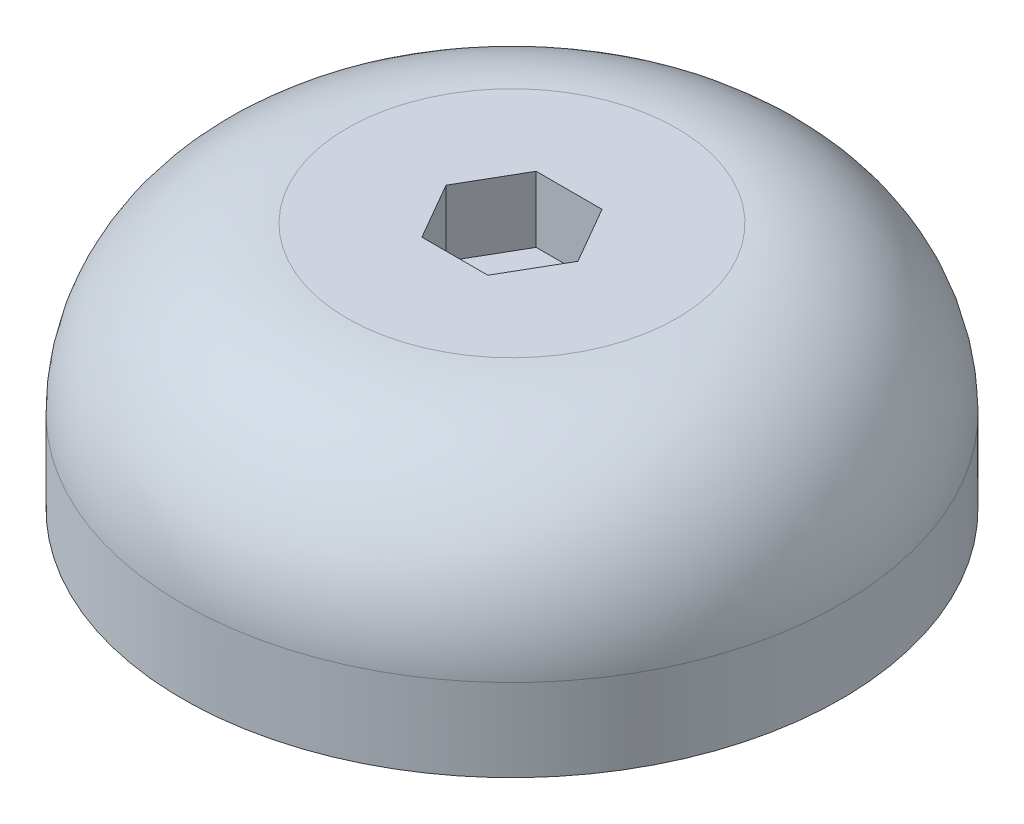
ISO-10303-21;
HEADER;
FILE_DESCRIPTION(('STEP AP214'),'2;1');
FILE_NAME('part.step','',(''),(''),'','','');
FILE_SCHEMA(('AUTOMOTIVE_DESIGN { 1 0 10303 214 1 1 1 1 }'));
ENDSEC;
DATA;
#1=APPLICATION_CONTEXT('core data for automotive mechanical design processes');
#2=APPLICATION_PROTOCOL_DEFINITION('international standard','automotive_design',2000,#1);
#3=PRODUCT_CONTEXT('',#1,'mechanical');
#4=PRODUCT('Part','Part','',(#3));
#5=PRODUCT_RELATED_PRODUCT_CATEGORY('part','',(#4));
#6=PRODUCT_DEFINITION_FORMATION('','',#4);
#7=PRODUCT_DEFINITION_CONTEXT('part definition',#1,'design');
#8=PRODUCT_DEFINITION('design','',#6,#7);
#9=PRODUCT_DEFINITION_SHAPE('','',#8);
#10=(LENGTH_UNIT() NAMED_UNIT(*) SI_UNIT(.MILLI.,.METRE.));
#11=(NAMED_UNIT(*) PLANE_ANGLE_UNIT() SI_UNIT($,.RADIAN.));
#12=(NAMED_UNIT(*) SI_UNIT($,.STERADIAN.) SOLID_ANGLE_UNIT());
#13=UNCERTAINTY_MEASURE_WITH_UNIT(LENGTH_MEASURE(1.E-05),#10,'distance_accuracy_value','');
#14=(GEOMETRIC_REPRESENTATION_CONTEXT(3) GLOBAL_UNCERTAINTY_ASSIGNED_CONTEXT((#13)) GLOBAL_UNIT_ASSIGNED_CONTEXT((#10,
#11,#12)) REPRESENTATION_CONTEXT('',''));
#15=CARTESIAN_POINT('',(0.,0.,0.));
#16=DIRECTION('',(0.,0.,1.));
#17=DIRECTION('',(1.,0.,0.));
#18=AXIS2_PLACEMENT_3D('',#15,#16,#17);
#19=CARTESIAN_POINT('',(0.,3.,0.));
#20=DIRECTION('',(0.,-1.,0.));
#21=DIRECTION('',(0.,0.,-1.));
#22=AXIS2_PLACEMENT_3D('',#19,#20,#21);
#23=CYLINDRICAL_SURFACE('',#22,2.);
#24=CARTESIAN_POINT('',(0.,0.,0.));
#25=DIRECTION('',(0.,1.,0.));
#26=DIRECTION('',(0.,0.,1.));
#27=AXIS2_PLACEMENT_3D('',#24,#25,#26);
#28=CIRCLE('',#27,2.);
#29=CARTESIAN_POINT('',(0.,0.,2.));
#30=VERTEX_POINT('',#29);
#31=EDGE_CURVE('E192',#30,#30,#28,.T.);
#32=ORIENTED_EDGE('',*,*,#31,.F.);
#33=EDGE_LOOP('',(#32));
#34=FACE_BOUND('',#33,.T.);
#35=CARTESIAN_POINT('',(0.,7.,0.));
#36=DIRECTION('',(0.,1.,0.));
#37=DIRECTION('',(0.,0.,1.));
#38=AXIS2_PLACEMENT_3D('',#35,#36,#37);
#39=CIRCLE('',#38,2.);
#40=CARTESIAN_POINT('',(0.,7.,2.));
#41=VERTEX_POINT('',#40);
#42=EDGE_CURVE('E157',#41,#41,#39,.T.);
#43=ORIENTED_EDGE('',*,*,#42,.T.);
#44=EDGE_LOOP('',(#43));
#45=FACE_BOUND('',#44,.T.);
#46=ADVANCED_FACE('F33',(#34,#45),#23,.F.);
#47=CARTESIAN_POINT('',(0.,0.,0.));
#48=DIRECTION('',(0.,1.,0.));
#49=DIRECTION('',(0.,0.,1.));
#50=AXIS2_PLACEMENT_3D('',#47,#48,#49);
#51=PLANE('',#50);
#52=DIRECTION('',(1.,0.,0.));
#53=VECTOR('',#52,1.);
#54=CARTESIAN_POINT('',(-1.6303294476589,0.,-7.61644171442611));
#55=LINE('',#54,#53);
#56=CARTESIAN_POINT('',(-1.6303294476589,0.,-7.61644171442611));
#57=VERTEX_POINT('',#56);
#58=CARTESIAN_POINT('',(1.5696705523411,0.,-7.61644171442611));
#59=VERTEX_POINT('',#58);
#60=EDGE_CURVE('E182',#57,#59,#55,.T.);
#61=ORIENTED_EDGE('',*,*,#60,.F.);
#62=DIRECTION('',(0.,0.,-1.));
#63=VECTOR('',#62,1.);
#64=CARTESIAN_POINT('',(-1.6303294476589,0.,-4.41644171442611));
#65=LINE('',#64,#63);
#66=CARTESIAN_POINT('',(-1.6303294476589,0.,-4.41644171442611));
#67=VERTEX_POINT('',#66);
#68=EDGE_CURVE('E168',#67,#57,#65,.T.);
#69=ORIENTED_EDGE('',*,*,#68,.F.);
#70=DIRECTION('',(-1.,0.,0.));
#71=VECTOR('',#70,1.);
#72=CARTESIAN_POINT('',(-1.6303294476589,0.,-4.41644171442611));
#73=LINE('',#72,#71);
#74=CARTESIAN_POINT('',(1.5696705523411,0.,-4.41644171442611));
#75=VERTEX_POINT('',#74);
#76=EDGE_CURVE('E173',#75,#67,#73,.T.);
#77=ORIENTED_EDGE('',*,*,#76,.F.);
#78=DIRECTION('',(0.,0.,1.));
#79=VECTOR('',#78,1.);
#80=CARTESIAN_POINT('',(1.5696705523411,0.,-4.41644171442611));
#81=LINE('',#80,#79);
#82=EDGE_CURVE('E185',#59,#75,#81,.T.);
#83=ORIENTED_EDGE('',*,*,#82,.F.);
#84=EDGE_LOOP('',(#61,#69,#77,#83));
#85=FACE_BOUND('',#84,.T.);
#86=CARTESIAN_POINT('',(0.,0.,0.));
#87=DIRECTION('',(0.,1.,0.));
#88=DIRECTION('',(0.,0.,1.));
#89=AXIS2_PLACEMENT_3D('',#86,#87,#88);
#90=CIRCLE('',#89,9.75);
#91=CARTESIAN_POINT('',(0.,0.,9.75));
#92=VERTEX_POINT('',#91);
#93=EDGE_CURVE('E201',#92,#92,#90,.T.);
#94=ORIENTED_EDGE('',*,*,#93,.F.);
#95=EDGE_LOOP('',(#94));
#96=FACE_BOUND('',#95,.T.);
#97=ORIENTED_EDGE('',*,*,#31,.T.);
#98=EDGE_LOOP('',(#97));
#99=FACE_BOUND('',#98,.T.);
#100=ADVANCED_FACE('F226',(#85,#96,#99),#51,.F.);
#101=CARTESIAN_POINT('',(-1.6303294476589,3.,-4.41644171442611));
#102=DIRECTION('',(-1.,0.,0.));
#103=DIRECTION('',(0.,0.,1.));
#104=AXIS2_PLACEMENT_3D('',#101,#102,#103);
#105=PLANE('',#104);
#106=ORIENTED_EDGE('',*,*,#68,.T.);
#107=DIRECTION('',(0.,-1.,0.));
#108=VECTOR('',#107,1.);
#109=CARTESIAN_POINT('',(-1.6303294476589,3.,-7.61644171442611));
#110=LINE('',#109,#108);
#111=CARTESIAN_POINT('',(-1.6303294476589,3.,-7.61644171442611));
#112=VERTEX_POINT('',#111);
#113=EDGE_CURVE('E180',#112,#57,#110,.T.);
#114=ORIENTED_EDGE('',*,*,#113,.F.);
#115=DIRECTION('',(0.,0.,-1.));
#116=VECTOR('',#115,1.);
#117=CARTESIAN_POINT('',(-1.6303294476589,3.,-4.41644171442611));
#118=LINE('',#117,#116);
#119=CARTESIAN_POINT('',(-1.6303294476589,3.,-4.41644171442611));
#120=VERTEX_POINT('',#119);
#121=EDGE_CURVE('E169',#120,#112,#118,.T.);
#122=ORIENTED_EDGE('',*,*,#121,.F.);
#123=DIRECTION('',(0.,-1.,0.));
#124=VECTOR('',#123,1.);
#125=CARTESIAN_POINT('',(-1.6303294476589,3.,-4.41644171442611));
#126=LINE('',#125,#124);
#127=EDGE_CURVE('E190',#120,#67,#126,.T.);
#128=ORIENTED_EDGE('',*,*,#127,.T.);
#129=EDGE_LOOP('',(#106,#114,#122,#128));
#130=FACE_BOUND('',#129,.T.);
#131=ADVANCED_FACE('F232',(#130),#105,.F.);
#132=CARTESIAN_POINT('',(-1.6303294476589,3.,-4.41644171442611));
#133=DIRECTION('',(0.,0.,1.));
#134=DIRECTION('',(1.,0.,0.));
#135=AXIS2_PLACEMENT_3D('',#132,#133,#134);
#136=PLANE('',#135);
#137=ORIENTED_EDGE('',*,*,#76,.T.);
#138=ORIENTED_EDGE('',*,*,#127,.F.);
#139=DIRECTION('',(-1.,0.,0.));
#140=VECTOR('',#139,1.);
#141=CARTESIAN_POINT('',(-1.6303294476589,3.,-4.41644171442611));
#142=LINE('',#141,#140);
#143=CARTESIAN_POINT('',(1.5696705523411,3.,-4.41644171442611));
#144=VERTEX_POINT('',#143);
#145=EDGE_CURVE('E177',#144,#120,#142,.T.);
#146=ORIENTED_EDGE('',*,*,#145,.F.);
#147=DIRECTION('',(0.,-1.,0.));
#148=VECTOR('',#147,1.);
#149=CARTESIAN_POINT('',(1.5696705523411,3.,-4.41644171442611));
#150=LINE('',#149,#148);
#151=EDGE_CURVE('E193',#144,#75,#150,.T.);
#152=ORIENTED_EDGE('',*,*,#151,.T.);
#153=EDGE_LOOP('',(#137,#138,#146,#152));
#154=FACE_BOUND('',#153,.T.);
#155=ADVANCED_FACE('F273',(#154),#136,.F.);
#156=CARTESIAN_POINT('',(1.5696705523411,3.,-4.41644171442611));
#157=DIRECTION('',(1.,0.,0.));
#158=DIRECTION('',(0.,0.,-1.));
#159=AXIS2_PLACEMENT_3D('',#156,#157,#158);
#160=PLANE('',#159);
#161=ORIENTED_EDGE('',*,*,#82,.T.);
#162=ORIENTED_EDGE('',*,*,#151,.F.);
#163=DIRECTION('',(0.,0.,1.));
#164=VECTOR('',#163,1.);
#165=CARTESIAN_POINT('',(1.5696705523411,3.,-4.41644171442611));
#166=LINE('',#165,#164);
#167=CARTESIAN_POINT('',(1.5696705523411,3.,-7.61644171442611));
#168=VERTEX_POINT('',#167);
#169=EDGE_CURVE('E56',#168,#144,#166,.T.);
#170=ORIENTED_EDGE('',*,*,#169,.F.);
#171=DIRECTION('',(0.,-1.,0.));
#172=VECTOR('',#171,1.);
#173=CARTESIAN_POINT('',(1.5696705523411,3.,-7.61644171442611));
#174=LINE('',#173,#172);
#175=EDGE_CURVE('E195',#168,#59,#174,.T.);
#176=ORIENTED_EDGE('',*,*,#175,.T.);
#177=EDGE_LOOP('',(#161,#162,#170,#176));
#178=FACE_BOUND('',#177,.T.);
#179=ADVANCED_FACE('F276',(#178),#160,.F.);
#180=CARTESIAN_POINT('',(-1.6303294476589,3.,-7.61644171442611));
#181=DIRECTION('',(0.,0.,-1.));
#182=DIRECTION('',(-1.,0.,0.));
#183=AXIS2_PLACEMENT_3D('',#180,#181,#182);
#184=PLANE('',#183);
#185=ORIENTED_EDGE('',*,*,#60,.T.);
#186=ORIENTED_EDGE('',*,*,#175,.F.);
#187=DIRECTION('',(1.,0.,0.));
#188=VECTOR('',#187,1.);
#189=CARTESIAN_POINT('',(-1.6303294476589,3.,-7.61644171442611));
#190=LINE('',#189,#188);
#191=EDGE_CURVE('E172',#112,#168,#190,.T.);
#192=ORIENTED_EDGE('',*,*,#191,.F.);
#193=ORIENTED_EDGE('',*,*,#113,.T.);
#194=EDGE_LOOP('',(#185,#186,#192,#193));
#195=FACE_BOUND('',#194,.T.);
#196=ADVANCED_FACE('F270',(#195),#184,.F.);
#197=CARTESIAN_POINT('',(0.,3.,0.));
#198=DIRECTION('',(0.,1.,0.));
#199=DIRECTION('',(0.,0.,1.));
#200=AXIS2_PLACEMENT_3D('',#197,#198,#199);
#201=PLANE('',#200);
#202=ORIENTED_EDGE('',*,*,#145,.T.);
#203=ORIENTED_EDGE('',*,*,#121,.T.);
#204=ORIENTED_EDGE('',*,*,#191,.T.);
#205=ORIENTED_EDGE('',*,*,#169,.T.);
#206=EDGE_LOOP('',(#202,#203,#204,#205));
#207=FACE_BOUND('',#206,.T.);
#208=ADVANCED_FACE('F268',(#207),#201,.F.);
#209=CARTESIAN_POINT('',(0.,-4.,0.));
#210=DIRECTION('',(0.,1.,0.));
#211=DIRECTION('',(0.,0.,1.));
#212=AXIS2_PLACEMENT_3D('',#209,#210,#211);
#213=CYLINDRICAL_SURFACE('',#212,9.75);
#214=CARTESIAN_POINT('',(0.,-3.5,0.));
#215=DIRECTION('',(0.,-1.,0.));
#216=DIRECTION('',(0.,0.,-1.));
#217=AXIS2_PLACEMENT_3D('',#214,#215,#216);
#218=CIRCLE('',#217,9.75);
#219=CARTESIAN_POINT('',(0.,-3.5,-9.75));
#220=VERTEX_POINT('',#219);
#221=EDGE_CURVE('E41',#220,#220,#218,.T.);
#222=ORIENTED_EDGE('',*,*,#221,.T.);
#223=EDGE_LOOP('',(#222));
#224=FACE_BOUND('',#223,.T.);
#225=ORIENTED_EDGE('',*,*,#93,.T.);
#226=EDGE_LOOP('',(#225));
#227=FACE_BOUND('',#226,.T.);
#228=ADVANCED_FACE('F214',(#224,#227),#213,.F.);
#229=CARTESIAN_POINT('',(0.,-4.,0.));
#230=DIRECTION('',(0.,-1.,0.));
#231=DIRECTION('',(0.,0.,-1.));
#232=AXIS2_PLACEMENT_3D('',#229,#230,#231);
#233=PLANE('',#232);
#234=CARTESIAN_POINT('',(0.,-4.,0.));
#235=DIRECTION('',(0.,-1.,0.));
#236=DIRECTION('',(0.,0.,-1.));
#237=AXIS2_PLACEMENT_3D('',#234,#235,#236);
#238=CIRCLE('',#237,10.25);
#239=CARTESIAN_POINT('',(0.,-4.,-10.25));
#240=VERTEX_POINT('',#239);
#241=EDGE_CURVE('E11',#240,#240,#238,.F.);
#242=ORIENTED_EDGE('',*,*,#241,.T.);
#243=EDGE_LOOP('',(#242));
#244=FACE_BOUND('',#243,.T.);
#245=CARTESIAN_POINT('',(0.,-4.,0.));
#246=DIRECTION('',(0.,-1.,0.));
#247=DIRECTION('',(0.,0.,-1.));
#248=AXIS2_PLACEMENT_3D('',#245,#246,#247);
#249=CIRCLE('',#248,20.);
#250=CARTESIAN_POINT('',(0.,-4.,-20.));
#251=VERTEX_POINT('',#250);
#252=EDGE_CURVE('E165',#251,#251,#249,.T.);
#253=ORIENTED_EDGE('',*,*,#252,.T.);
#254=EDGE_LOOP('',(#253));
#255=FACE_BOUND('',#254,.T.);
#256=ADVANCED_FACE('F257',(#244,#255),#233,.T.);
#257=CARTESIAN_POINT('',(0.,11.,0.));
#258=DIRECTION('',(0.,1.,0.));
#259=DIRECTION('',(0.,0.,1.));
#260=AXIS2_PLACEMENT_3D('',#257,#258,#259);
#261=PLANE('',#260);
#262=DIRECTION('',(0.5,0.,-0.866025403784439));
#263=VECTOR('',#262,1.);
#264=CARTESIAN_POINT('',(2.00051868274205,11.,3.465));
#265=LINE('',#264,#263);
#266=CARTESIAN_POINT('',(2.00051868274205,11.,3.465));
#267=VERTEX_POINT('',#266);
#268=CARTESIAN_POINT('',(4.00103736548411,11.,0.));
#269=VERTEX_POINT('',#268);
#270=EDGE_CURVE('E48',#267,#269,#265,.T.);
#271=ORIENTED_EDGE('',*,*,#270,.F.);
#272=DIRECTION('',(1.,0.,0.));
#273=VECTOR('',#272,1.);
#274=CARTESIAN_POINT('',(-2.00051868274205,11.,3.465));
#275=LINE('',#274,#273);
#276=CARTESIAN_POINT('',(-2.00051868274205,11.,3.465));
#277=VERTEX_POINT('',#276);
#278=EDGE_CURVE('E131',#277,#267,#275,.T.);
#279=ORIENTED_EDGE('',*,*,#278,.F.);
#280=DIRECTION('',(0.5,0.,0.866025403784439));
#281=VECTOR('',#280,1.);
#282=CARTESIAN_POINT('',(-4.00103736548411,11.,0.));
#283=LINE('',#282,#281);
#284=CARTESIAN_POINT('',(-4.00103736548411,11.,0.));
#285=VERTEX_POINT('',#284);
#286=EDGE_CURVE('E134',#285,#277,#283,.T.);
#287=ORIENTED_EDGE('',*,*,#286,.F.);
#288=DIRECTION('',(-0.5,0.,0.866025403784439));
#289=VECTOR('',#288,1.);
#290=CARTESIAN_POINT('',(-2.00051868274205,11.,-3.465));
#291=LINE('',#290,#289);
#292=CARTESIAN_POINT('',(-2.00051868274205,11.,-3.465));
#293=VERTEX_POINT('',#292);
#294=EDGE_CURVE('E150',#293,#285,#291,.T.);
#295=ORIENTED_EDGE('',*,*,#294,.F.);
#296=DIRECTION('',(-1.,0.,0.));
#297=VECTOR('',#296,1.);
#298=CARTESIAN_POINT('',(2.00051868274205,11.,-3.465));
#299=LINE('',#298,#297);
#300=CARTESIAN_POINT('',(2.00051868274205,11.,-3.465));
#301=VERTEX_POINT('',#300);
#302=EDGE_CURVE('E147',#301,#293,#299,.T.);
#303=ORIENTED_EDGE('',*,*,#302,.F.);
#304=DIRECTION('',(-0.5,0.,-0.866025403784439));
#305=VECTOR('',#304,1.);
#306=CARTESIAN_POINT('',(4.00103736548411,11.,0.));
#307=LINE('',#306,#305);
#308=EDGE_CURVE('E145',#269,#301,#307,.T.);
#309=ORIENTED_EDGE('',*,*,#308,.F.);
#310=EDGE_LOOP('',(#271,#279,#287,#295,#303,#309));
#311=FACE_BOUND('',#310,.T.);
#312=CARTESIAN_POINT('',(0.,11.,0.));
#313=DIRECTION('',(0.,1.,0.));
#314=DIRECTION('',(0.,0.,1.));
#315=AXIS2_PLACEMENT_3D('',#312,#313,#314);
#316=CIRCLE('',#315,10.);
#317=CARTESIAN_POINT('',(0.,11.,10.));
#318=VERTEX_POINT('',#317);
#319=EDGE_CURVE('E204',#318,#318,#316,.T.);
#320=ORIENTED_EDGE('',*,*,#319,.T.);
#321=EDGE_LOOP('',(#320));
#322=FACE_BOUND('',#321,.T.);
#323=ADVANCED_FACE('F249',(#311,#322),#261,.T.);
#324=CARTESIAN_POINT('',(0.,11.,0.));
#325=DIRECTION('',(0.,-1.,0.));
#326=DIRECTION('',(0.,0.,-1.));
#327=AXIS2_PLACEMENT_3D('',#324,#325,#326);
#328=CYLINDRICAL_SURFACE('',#327,20.);
#329=CARTESIAN_POINT('',(0.,0.999999999999999,0.));
#330=DIRECTION('',(0.,1.,0.));
#331=DIRECTION('',(0.,0.,1.));
#332=AXIS2_PLACEMENT_3D('',#329,#330,#331);
#333=CIRCLE('',#332,20.);
#334=CARTESIAN_POINT('',(0.,0.999999999999999,20.));
#335=VERTEX_POINT('',#334);
#336=EDGE_CURVE('E207',#335,#335,#333,.F.);
#337=ORIENTED_EDGE('',*,*,#336,.T.);
#338=EDGE_LOOP('',(#337));
#339=FACE_BOUND('',#338,.T.);
#340=ORIENTED_EDGE('',*,*,#252,.F.);
#341=EDGE_LOOP('',(#340));
#342=FACE_BOUND('',#341,.T.);
#343=ADVANCED_FACE('F241',(#339,#342),#328,.T.);
#344=CARTESIAN_POINT('',(0.,0.999999999999999,0.));
#345=DIRECTION('',(0.,1.,0.));
#346=DIRECTION('',(0.,0.,1.));
#347=AXIS2_PLACEMENT_3D('',#344,#345,#346);
#348=DEGENERATE_TOROIDAL_SURFACE('',#347,10.,10.,.T.);
#349=ORIENTED_EDGE('',*,*,#336,.F.);
#350=EDGE_LOOP('',(#349));
#351=FACE_BOUND('',#350,.T.);
#352=ORIENTED_EDGE('',*,*,#319,.F.);
#353=EDGE_LOOP('',(#352));
#354=FACE_BOUND('',#353,.T.);
#355=ADVANCED_FACE('F239',(#351,#354),#348,.T.);
#356=CARTESIAN_POINT('',(2.00051868274205,7.,3.465));
#357=DIRECTION('',(0.866025403784439,0.,0.5));
#358=DIRECTION('',(0.5,0.,-0.866025403784439));
#359=AXIS2_PLACEMENT_3D('',#356,#357,#358);
#360=PLANE('',#359);
#361=ORIENTED_EDGE('',*,*,#270,.T.);
#362=DIRECTION('',(0.,1.,0.));
#363=VECTOR('',#362,1.);
#364=CARTESIAN_POINT('',(4.00103736548411,7.,0.));
#365=LINE('',#364,#363);
#366=CARTESIAN_POINT('',(4.00103736548411,7.,0.));
#367=VERTEX_POINT('',#366);
#368=EDGE_CURVE('E108',#367,#269,#365,.T.);
#369=ORIENTED_EDGE('',*,*,#368,.F.);
#370=DIRECTION('',(0.5,0.,-0.866025403784439));
#371=VECTOR('',#370,1.);
#372=CARTESIAN_POINT('',(2.00051868274205,7.,3.465));
#373=LINE('',#372,#371);
#374=CARTESIAN_POINT('',(2.00051868274205,7.,3.465));
#375=VERTEX_POINT('',#374);
#376=EDGE_CURVE('E112',#375,#367,#373,.T.);
#377=ORIENTED_EDGE('',*,*,#376,.F.);
#378=DIRECTION('',(0.,1.,0.));
#379=VECTOR('',#378,1.);
#380=CARTESIAN_POINT('',(2.00051868274205,7.,3.465));
#381=LINE('',#380,#379);
#382=EDGE_CURVE('E155',#375,#267,#381,.T.);
#383=ORIENTED_EDGE('',*,*,#382,.T.);
#384=EDGE_LOOP('',(#361,#369,#377,#383));
#385=FACE_BOUND('',#384,.T.);
#386=ADVANCED_FACE('F110',(#385),#360,.F.);
#387=CARTESIAN_POINT('',(-2.00051868274205,7.,3.465));
#388=DIRECTION('',(0.,0.,1.));
#389=DIRECTION('',(1.,0.,0.));
#390=AXIS2_PLACEMENT_3D('',#387,#388,#389);
#391=PLANE('',#390);
#392=ORIENTED_EDGE('',*,*,#278,.T.);
#393=ORIENTED_EDGE('',*,*,#382,.F.);
#394=DIRECTION('',(1.,0.,0.));
#395=VECTOR('',#394,1.);
#396=CARTESIAN_POINT('',(-2.00051868274205,7.,3.465));
#397=LINE('',#396,#395);
#398=CARTESIAN_POINT('',(-2.00051868274205,7.,3.465));
#399=VERTEX_POINT('',#398);
#400=EDGE_CURVE('E118',#399,#375,#397,.T.);
#401=ORIENTED_EDGE('',*,*,#400,.F.);
#402=DIRECTION('',(0.,1.,0.));
#403=VECTOR('',#402,1.);
#404=CARTESIAN_POINT('',(-2.00051868274205,7.,3.465));
#405=LINE('',#404,#403);
#406=EDGE_CURVE('E158',#399,#277,#405,.T.);
#407=ORIENTED_EDGE('',*,*,#406,.T.);
#408=EDGE_LOOP('',(#392,#393,#401,#407));
#409=FACE_BOUND('',#408,.T.);
#410=ADVANCED_FACE('F247',(#409),#391,.F.);
#411=CARTESIAN_POINT('',(-4.00103736548411,7.,0.));
#412=DIRECTION('',(-0.866025403784439,0.,0.5));
#413=DIRECTION('',(0.5,0.,0.866025403784439));
#414=AXIS2_PLACEMENT_3D('',#411,#412,#413);
#415=PLANE('',#414);
#416=ORIENTED_EDGE('',*,*,#286,.T.);
#417=ORIENTED_EDGE('',*,*,#406,.F.);
#418=DIRECTION('',(0.5,0.,0.866025403784439));
#419=VECTOR('',#418,1.);
#420=CARTESIAN_POINT('',(-4.00103736548411,7.,0.));
#421=LINE('',#420,#419);
#422=CARTESIAN_POINT('',(-4.00103736548411,7.,0.));
#423=VERTEX_POINT('',#422);
#424=EDGE_CURVE('E141',#423,#399,#421,.T.);
#425=ORIENTED_EDGE('',*,*,#424,.F.);
#426=DIRECTION('',(0.,1.,0.));
#427=VECTOR('',#426,1.);
#428=CARTESIAN_POINT('',(-4.00103736548411,7.,0.));
#429=LINE('',#428,#427);
#430=EDGE_CURVE('E160',#423,#285,#429,.T.);
#431=ORIENTED_EDGE('',*,*,#430,.T.);
#432=EDGE_LOOP('',(#416,#417,#425,#431));
#433=FACE_BOUND('',#432,.T.);
#434=ADVANCED_FACE('F353',(#433),#415,.F.);
#435=CARTESIAN_POINT('',(-2.00051868274205,7.,-3.465));
#436=DIRECTION('',(-0.866025403784439,0.,-0.5));
#437=DIRECTION('',(-0.5,0.,0.866025403784439));
#438=AXIS2_PLACEMENT_3D('',#435,#436,#437);
#439=PLANE('',#438);
#440=ORIENTED_EDGE('',*,*,#294,.T.);
#441=ORIENTED_EDGE('',*,*,#430,.F.);
#442=DIRECTION('',(-0.5,0.,0.866025403784439));
#443=VECTOR('',#442,1.);
#444=CARTESIAN_POINT('',(-2.00051868274205,7.,-3.465));
#445=LINE('',#444,#443);
#446=CARTESIAN_POINT('',(-2.00051868274205,7.,-3.465));
#447=VERTEX_POINT('',#446);
#448=EDGE_CURVE('E138',#447,#423,#445,.T.);
#449=ORIENTED_EDGE('',*,*,#448,.F.);
#450=DIRECTION('',(0.,1.,0.));
#451=VECTOR('',#450,1.);
#452=CARTESIAN_POINT('',(-2.00051868274205,7.,-3.465));
#453=LINE('',#452,#451);
#454=EDGE_CURVE('E162',#447,#293,#453,.T.);
#455=ORIENTED_EDGE('',*,*,#454,.T.);
#456=EDGE_LOOP('',(#440,#441,#449,#455));
#457=FACE_BOUND('',#456,.T.);
#458=ADVANCED_FACE('F363',(#457),#439,.F.);
#459=CARTESIAN_POINT('',(2.00051868274205,7.,-3.465));
#460=DIRECTION('',(0.,0.,-1.));
#461=DIRECTION('',(-1.,0.,0.));
#462=AXIS2_PLACEMENT_3D('',#459,#460,#461);
#463=PLANE('',#462);
#464=ORIENTED_EDGE('',*,*,#302,.T.);
#465=ORIENTED_EDGE('',*,*,#454,.F.);
#466=DIRECTION('',(-1.,0.,0.));
#467=VECTOR('',#466,1.);
#468=CARTESIAN_POINT('',(2.00051868274205,7.,-3.465));
#469=LINE('',#468,#467);
#470=CARTESIAN_POINT('',(2.00051868274205,7.,-3.465));
#471=VERTEX_POINT('',#470);
#472=EDGE_CURVE('E126',#471,#447,#469,.T.);
#473=ORIENTED_EDGE('',*,*,#472,.F.);
#474=DIRECTION('',(0.,1.,0.));
#475=VECTOR('',#474,1.);
#476=CARTESIAN_POINT('',(2.00051868274205,7.,-3.465));
#477=LINE('',#476,#475);
#478=EDGE_CURVE('E117',#471,#301,#477,.T.);
#479=ORIENTED_EDGE('',*,*,#478,.T.);
#480=EDGE_LOOP('',(#464,#465,#473,#479));
#481=FACE_BOUND('',#480,.T.);
#482=ADVANCED_FACE('F373',(#481),#463,.F.);
#483=CARTESIAN_POINT('',(4.00103736548411,7.,0.));
#484=DIRECTION('',(0.866025403784439,0.,-0.5));
#485=DIRECTION('',(-0.5,0.,-0.866025403784439));
#486=AXIS2_PLACEMENT_3D('',#483,#484,#485);
#487=PLANE('',#486);
#488=ORIENTED_EDGE('',*,*,#308,.T.);
#489=ORIENTED_EDGE('',*,*,#478,.F.);
#490=DIRECTION('',(-0.5,0.,-0.866025403784439));
#491=VECTOR('',#490,1.);
#492=CARTESIAN_POINT('',(4.00103736548411,7.,0.));
#493=LINE('',#492,#491);
#494=EDGE_CURVE('E121',#367,#471,#493,.T.);
#495=ORIENTED_EDGE('',*,*,#494,.F.);
#496=ORIENTED_EDGE('',*,*,#368,.T.);
#497=EDGE_LOOP('',(#488,#489,#495,#496));
#498=FACE_BOUND('',#497,.T.);
#499=ADVANCED_FACE('F122',(#498),#487,.F.);
#500=CARTESIAN_POINT('',(0.,7.,0.));
#501=DIRECTION('',(0.,1.,0.));
#502=DIRECTION('',(0.,0.,1.));
#503=AXIS2_PLACEMENT_3D('',#500,#501,#502);
#504=PLANE('',#503);
#505=ORIENTED_EDGE('',*,*,#42,.F.);
#506=EDGE_LOOP('',(#505));
#507=FACE_BOUND('',#506,.T.);
#508=ORIENTED_EDGE('',*,*,#376,.T.);
#509=ORIENTED_EDGE('',*,*,#494,.T.);
#510=ORIENTED_EDGE('',*,*,#472,.T.);
#511=ORIENTED_EDGE('',*,*,#448,.T.);
#512=ORIENTED_EDGE('',*,*,#424,.T.);
#513=ORIENTED_EDGE('',*,*,#400,.T.);
#514=EDGE_LOOP('',(#508,#509,#510,#511,#512,#513));
#515=FACE_BOUND('',#514,.T.);
#516=ADVANCED_FACE('F128',(#507,#515),#504,.T.);
#517=CARTESIAN_POINT('',(0.,-3.5,0.));
#518=DIRECTION('',(0.,-1.,0.));
#519=DIRECTION('',(0.,0.,-1.));
#520=AXIS2_PLACEMENT_3D('',#517,#518,#519);
#521=TOROIDAL_SURFACE('',#520,10.25,0.5);
#522=ORIENTED_EDGE('',*,*,#241,.F.);
#523=EDGE_LOOP('',(#522));
#524=FACE_BOUND('',#523,.T.);
#525=ORIENTED_EDGE('',*,*,#221,.F.);
#526=EDGE_LOOP('',(#525));
#527=FACE_BOUND('',#526,.T.);
#528=ADVANCED_FACE('F35',(#524,#527),#521,.T.);
#529=CLOSED_SHELL('',(#46,#100,#131,#155,#179,#196,#208,#228,#256,#323,#343,#355,#386,#410,#434,
#458,#482,#499,#516,#528));
#530=MANIFOLD_SOLID_BREP('B2',#529);
#531=ADVANCED_BREP_SHAPE_REPRESENTATION('',(#18,#530),#14);
#532=SHAPE_DEFINITION_REPRESENTATION(#9,#531);
ENDSEC;
END-ISO-10303-21;
